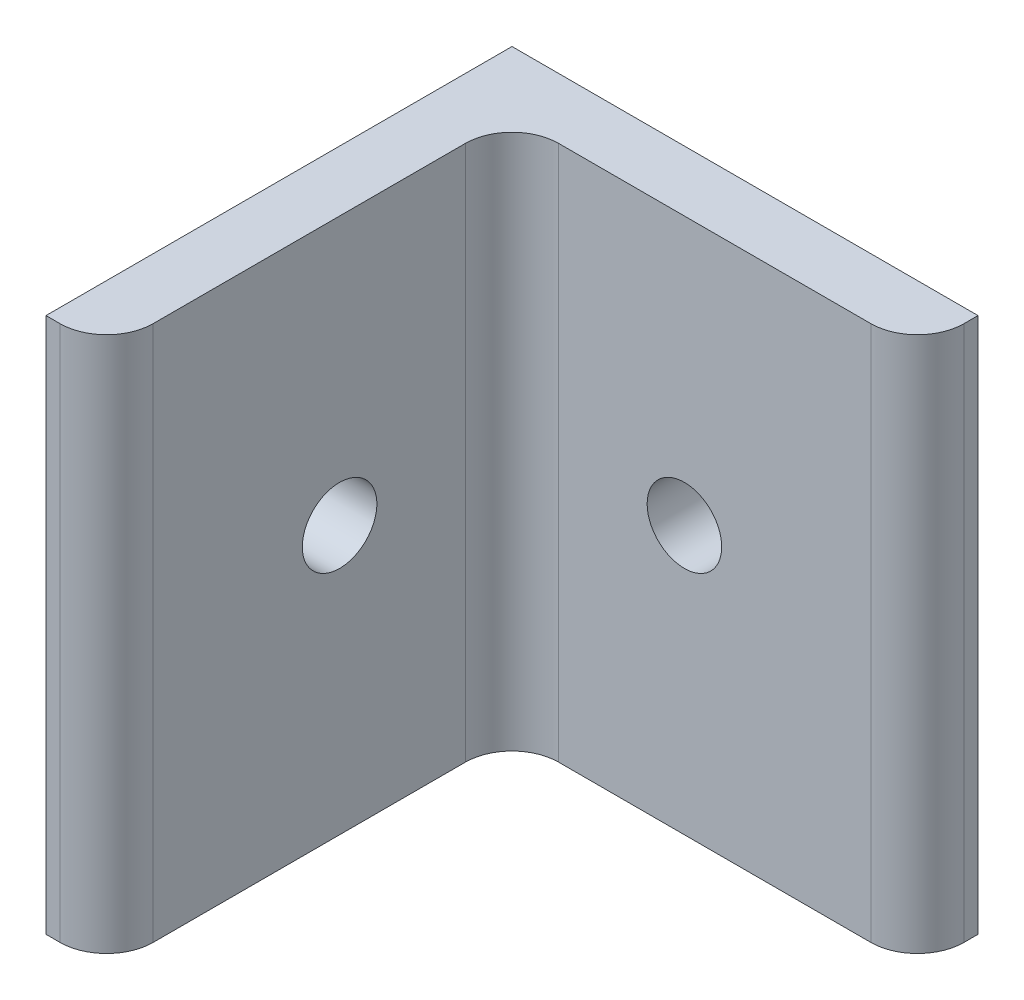
ISO-10303-21;
HEADER;
FILE_DESCRIPTION(('STEP AP214'),'2;1');
FILE_NAME('part.step','',(''),(''),'','','');
FILE_SCHEMA(('AUTOMOTIVE_DESIGN { 1 0 10303 214 1 1 1 1 }'));
ENDSEC;
DATA;
#1=APPLICATION_CONTEXT('core data for automotive mechanical design processes');
#2=APPLICATION_PROTOCOL_DEFINITION('international standard','automotive_design',2000,#1);
#3=PRODUCT_CONTEXT('',#1,'mechanical');
#4=PRODUCT('Part','Part','',(#3));
#5=PRODUCT_RELATED_PRODUCT_CATEGORY('part','',(#4));
#6=PRODUCT_DEFINITION_FORMATION('','',#4);
#7=PRODUCT_DEFINITION_CONTEXT('part definition',#1,'design');
#8=PRODUCT_DEFINITION('design','',#6,#7);
#9=PRODUCT_DEFINITION_SHAPE('','',#8);
#10=(LENGTH_UNIT() NAMED_UNIT(*) SI_UNIT(.MILLI.,.METRE.));
#11=(NAMED_UNIT(*) PLANE_ANGLE_UNIT() SI_UNIT($,.RADIAN.));
#12=(NAMED_UNIT(*) SI_UNIT($,.STERADIAN.) SOLID_ANGLE_UNIT());
#13=UNCERTAINTY_MEASURE_WITH_UNIT(LENGTH_MEASURE(1.E-05),#10,'distance_accuracy_value','');
#14=(GEOMETRIC_REPRESENTATION_CONTEXT(3) GLOBAL_UNCERTAINTY_ASSIGNED_CONTEXT((#13)) GLOBAL_UNIT_ASSIGNED_CONTEXT((#10,
#11,#12)) REPRESENTATION_CONTEXT('',''));
#15=CARTESIAN_POINT('',(0.,0.,0.));
#16=DIRECTION('',(0.,0.,1.));
#17=DIRECTION('',(1.,0.,0.));
#18=AXIS2_PLACEMENT_3D('',#15,#16,#17);
#19=CARTESIAN_POINT('',(25.4,29.21,0.));
#20=DIRECTION('',(0.,0.,1.));
#21=DIRECTION('',(1.,0.,0.));
#22=AXIS2_PLACEMENT_3D('',#19,#20,#21);
#23=PLANE('',#22);
#24=CARTESIAN_POINT('',(12.7,14.605,0.));
#25=DIRECTION('',(0.,0.,-1.));
#26=DIRECTION('',(-1.,0.,0.));
#27=AXIS2_PLACEMENT_3D('',#24,#25,#26);
#28=CIRCLE('',#27,2.03199999999999);
#29=CARTESIAN_POINT('',(10.668,14.605,0.));
#30=VERTEX_POINT('',#29);
#31=EDGE_CURVE('E198',#30,#30,#28,.T.);
#32=ORIENTED_EDGE('',*,*,#31,.F.);
#33=EDGE_LOOP('',(#32));
#34=FACE_BOUND('',#33,.T.);
#35=DIRECTION('',(-1.,0.,0.));
#36=VECTOR('',#35,1.);
#37=CARTESIAN_POINT('',(25.4,0.,0.));
#38=LINE('',#37,#36);
#39=CARTESIAN_POINT('',(25.4,0.,0.));
#40=VERTEX_POINT('',#39);
#41=CARTESIAN_POINT('',(0.,0.,0.));
#42=VERTEX_POINT('',#41);
#43=EDGE_CURVE('E142',#40,#42,#38,.T.);
#44=ORIENTED_EDGE('',*,*,#43,.T.);
#45=DIRECTION('',(0.,-1.,0.));
#46=VECTOR('',#45,1.);
#47=CARTESIAN_POINT('',(0.,29.21,0.));
#48=LINE('',#47,#46);
#49=CARTESIAN_POINT('',(0.,29.21,0.));
#50=VERTEX_POINT('',#49);
#51=EDGE_CURVE('E122',#50,#42,#48,.T.);
#52=ORIENTED_EDGE('',*,*,#51,.F.);
#53=DIRECTION('',(-1.,0.,0.));
#54=VECTOR('',#53,1.);
#55=CARTESIAN_POINT('',(25.4,29.21,0.));
#56=LINE('',#55,#54);
#57=CARTESIAN_POINT('',(25.4,29.21,0.));
#58=VERTEX_POINT('',#57);
#59=EDGE_CURVE('E130',#58,#50,#56,.T.);
#60=ORIENTED_EDGE('',*,*,#59,.F.);
#61=DIRECTION('',(0.,-1.,0.));
#62=VECTOR('',#61,1.);
#63=CARTESIAN_POINT('',(25.4,29.21,0.));
#64=LINE('',#63,#62);
#65=EDGE_CURVE('E150',#58,#40,#64,.T.);
#66=ORIENTED_EDGE('',*,*,#65,.T.);
#67=EDGE_LOOP('',(#44,#52,#60,#66));
#68=FACE_BOUND('',#67,.T.);
#69=ADVANCED_FACE('F43',(#34,#68),#23,.F.);
#70=CARTESIAN_POINT('',(0.,29.21,0.));
#71=DIRECTION('',(1.,0.,0.));
#72=DIRECTION('',(0.,0.,-1.));
#73=AXIS2_PLACEMENT_3D('',#70,#71,#72);
#74=PLANE('',#73);
#75=CARTESIAN_POINT('',(0.,14.605,12.7));
#76=DIRECTION('',(-1.,0.,0.));
#77=DIRECTION('',(0.,0.,1.));
#78=AXIS2_PLACEMENT_3D('',#75,#76,#77);
#79=CIRCLE('',#78,2.032);
#80=CARTESIAN_POINT('',(0.,14.605,14.732));
#81=VERTEX_POINT('',#80);
#82=EDGE_CURVE('E185',#81,#81,#79,.T.);
#83=ORIENTED_EDGE('',*,*,#82,.F.);
#84=EDGE_LOOP('',(#83));
#85=FACE_BOUND('',#84,.T.);
#86=DIRECTION('',(0.,0.,1.));
#87=VECTOR('',#86,1.);
#88=CARTESIAN_POINT('',(0.,0.,0.));
#89=LINE('',#88,#87);
#90=CARTESIAN_POINT('',(0.,0.,25.4));
#91=VERTEX_POINT('',#90);
#92=EDGE_CURVE('E190',#42,#91,#89,.T.);
#93=ORIENTED_EDGE('',*,*,#92,.T.);
#94=DIRECTION('',(0.,-1.,0.));
#95=VECTOR('',#94,1.);
#96=CARTESIAN_POINT('',(0.,29.21,25.4));
#97=LINE('',#96,#95);
#98=CARTESIAN_POINT('',(0.,29.21,25.4));
#99=VERTEX_POINT('',#98);
#100=EDGE_CURVE('E125',#99,#91,#97,.T.);
#101=ORIENTED_EDGE('',*,*,#100,.F.);
#102=DIRECTION('',(0.,0.,1.));
#103=VECTOR('',#102,1.);
#104=CARTESIAN_POINT('',(0.,29.21,0.));
#105=LINE('',#104,#103);
#106=EDGE_CURVE('E118',#50,#99,#105,.T.);
#107=ORIENTED_EDGE('',*,*,#106,.F.);
#108=ORIENTED_EDGE('',*,*,#51,.T.);
#109=EDGE_LOOP('',(#93,#101,#107,#108));
#110=FACE_BOUND('',#109,.T.);
#111=ADVANCED_FACE('F120',(#85,#110),#74,.F.);
#112=CARTESIAN_POINT('',(0.,29.21,25.4));
#113=DIRECTION('',(0.,0.,-1.));
#114=DIRECTION('',(-1.,0.,0.));
#115=AXIS2_PLACEMENT_3D('',#112,#113,#114);
#116=PLANE('',#115);
#117=DIRECTION('',(1.,0.,0.));
#118=VECTOR('',#117,1.);
#119=CARTESIAN_POINT('',(0.,0.,25.4));
#120=LINE('',#119,#118);
#121=CARTESIAN_POINT('',(0.762000000000005,0.,25.4));
#122=VERTEX_POINT('',#121);
#123=EDGE_CURVE('E214',#91,#122,#120,.T.);
#124=ORIENTED_EDGE('',*,*,#123,.T.);
#125=DIRECTION('',(0.,-1.,0.));
#126=VECTOR('',#125,1.);
#127=CARTESIAN_POINT('',(0.762000000000005,29.21,25.4));
#128=LINE('',#127,#126);
#129=CARTESIAN_POINT('',(0.762000000000005,29.21,25.4));
#130=VERTEX_POINT('',#129);
#131=EDGE_CURVE('E163',#122,#130,#128,.F.);
#132=ORIENTED_EDGE('',*,*,#131,.T.);
#133=DIRECTION('',(1.,0.,0.));
#134=VECTOR('',#133,1.);
#135=CARTESIAN_POINT('',(0.,29.21,25.4));
#136=LINE('',#135,#134);
#137=EDGE_CURVE('E129',#99,#130,#136,.T.);
#138=ORIENTED_EDGE('',*,*,#137,.F.);
#139=ORIENTED_EDGE('',*,*,#100,.T.);
#140=EDGE_LOOP('',(#124,#132,#138,#139));
#141=FACE_BOUND('',#140,.T.);
#142=ADVANCED_FACE('F234',(#141),#116,.F.);
#143=CARTESIAN_POINT('',(3.302,29.21,25.4));
#144=DIRECTION('',(-1.,0.,0.));
#145=DIRECTION('',(0.,0.,1.));
#146=AXIS2_PLACEMENT_3D('',#143,#144,#145);
#147=PLANE('',#146);
#148=CARTESIAN_POINT('',(3.302,14.605,12.7));
#149=DIRECTION('',(-1.,0.,0.));
#150=DIRECTION('',(0.,0.,1.));
#151=AXIS2_PLACEMENT_3D('',#148,#149,#150);
#152=CIRCLE('',#151,2.032);
#153=CARTESIAN_POINT('',(3.302,14.605,14.732));
#154=VERTEX_POINT('',#153);
#155=EDGE_CURVE('E182',#154,#154,#152,.T.);
#156=ORIENTED_EDGE('',*,*,#155,.T.);
#157=EDGE_LOOP('',(#156));
#158=FACE_BOUND('',#157,.T.);
#159=DIRECTION('',(0.,0.,-1.));
#160=VECTOR('',#159,1.);
#161=CARTESIAN_POINT('',(3.302,29.21,25.4));
#162=LINE('',#161,#160);
#163=CARTESIAN_POINT('',(3.302,29.21,22.86));
#164=VERTEX_POINT('',#163);
#165=CARTESIAN_POINT('',(3.302,29.21,5.842));
#166=VERTEX_POINT('',#165);
#167=EDGE_CURVE('E203',#164,#166,#162,.T.);
#168=ORIENTED_EDGE('',*,*,#167,.F.);
#169=DIRECTION('',(0.,-1.,0.));
#170=VECTOR('',#169,1.);
#171=CARTESIAN_POINT('',(3.302,29.21,22.86));
#172=LINE('',#171,#170);
#173=CARTESIAN_POINT('',(3.302,0.,22.86));
#174=VERTEX_POINT('',#173);
#175=EDGE_CURVE('E148',#164,#174,#172,.T.);
#176=ORIENTED_EDGE('',*,*,#175,.T.);
#177=DIRECTION('',(0.,0.,-1.));
#178=VECTOR('',#177,1.);
#179=CARTESIAN_POINT('',(3.302,0.,25.4));
#180=LINE('',#179,#178);
#181=CARTESIAN_POINT('',(3.302,0.,5.842));
#182=VERTEX_POINT('',#181);
#183=EDGE_CURVE('E218',#174,#182,#180,.T.);
#184=ORIENTED_EDGE('',*,*,#183,.T.);
#185=DIRECTION('',(0.,-1.,0.));
#186=VECTOR('',#185,1.);
#187=CARTESIAN_POINT('',(3.302,29.21,5.842));
#188=LINE('',#187,#186);
#189=EDGE_CURVE('E144',#182,#166,#188,.F.);
#190=ORIENTED_EDGE('',*,*,#189,.T.);
#191=EDGE_LOOP('',(#168,#176,#184,#190));
#192=FACE_BOUND('',#191,.T.);
#193=ADVANCED_FACE('F242',(#158,#192),#147,.F.);
#194=CARTESIAN_POINT('',(3.302,29.21,3.302));
#195=DIRECTION('',(0.,0.,-1.));
#196=DIRECTION('',(-1.,0.,0.));
#197=AXIS2_PLACEMENT_3D('',#194,#195,#196);
#198=PLANE('',#197);
#199=CARTESIAN_POINT('',(12.7,14.605,3.302));
#200=DIRECTION('',(0.,0.,-1.));
#201=DIRECTION('',(-1.,0.,0.));
#202=AXIS2_PLACEMENT_3D('',#199,#200,#201);
#203=CIRCLE('',#202,2.03199999999999);
#204=CARTESIAN_POINT('',(10.668,14.605,3.302));
#205=VERTEX_POINT('',#204);
#206=EDGE_CURVE('E47',#205,#205,#203,.T.);
#207=ORIENTED_EDGE('',*,*,#206,.T.);
#208=EDGE_LOOP('',(#207));
#209=FACE_BOUND('',#208,.T.);
#210=DIRECTION('',(1.,0.,0.));
#211=VECTOR('',#210,1.);
#212=CARTESIAN_POINT('',(3.302,0.,3.302));
#213=LINE('',#212,#211);
#214=CARTESIAN_POINT('',(5.842,0.,3.302));
#215=VERTEX_POINT('',#214);
#216=CARTESIAN_POINT('',(22.86,0.,3.302));
#217=VERTEX_POINT('',#216);
#218=EDGE_CURVE('E222',#215,#217,#213,.T.);
#219=ORIENTED_EDGE('',*,*,#218,.T.);
#220=DIRECTION('',(0.,-1.,0.));
#221=VECTOR('',#220,1.);
#222=CARTESIAN_POINT('',(22.86,29.21,3.302));
#223=LINE('',#222,#221);
#224=CARTESIAN_POINT('',(22.86,29.21,3.302));
#225=VERTEX_POINT('',#224);
#226=EDGE_CURVE('E69',#217,#225,#223,.F.);
#227=ORIENTED_EDGE('',*,*,#226,.T.);
#228=DIRECTION('',(1.,0.,0.));
#229=VECTOR('',#228,1.);
#230=CARTESIAN_POINT('',(3.302,29.21,3.302));
#231=LINE('',#230,#229);
#232=CARTESIAN_POINT('',(5.842,29.21,3.302));
#233=VERTEX_POINT('',#232);
#234=EDGE_CURVE('E207',#233,#225,#231,.T.);
#235=ORIENTED_EDGE('',*,*,#234,.F.);
#236=DIRECTION('',(0.,-1.,0.));
#237=VECTOR('',#236,1.);
#238=CARTESIAN_POINT('',(5.842,0.,3.302));
#239=LINE('',#238,#237);
#240=EDGE_CURVE('E175',#233,#215,#239,.T.);
#241=ORIENTED_EDGE('',*,*,#240,.T.);
#242=EDGE_LOOP('',(#219,#227,#235,#241));
#243=FACE_BOUND('',#242,.T.);
#244=ADVANCED_FACE('F248',(#209,#243),#198,.F.);
#245=CARTESIAN_POINT('',(25.4,29.21,3.302));
#246=DIRECTION('',(-1.,0.,0.));
#247=DIRECTION('',(0.,0.,1.));
#248=AXIS2_PLACEMENT_3D('',#245,#246,#247);
#249=PLANE('',#248);
#250=DIRECTION('',(0.,0.,-1.));
#251=VECTOR('',#250,1.);
#252=CARTESIAN_POINT('',(25.4,29.21,3.302));
#253=LINE('',#252,#251);
#254=CARTESIAN_POINT('',(25.4,29.21,0.761999999999997));
#255=VERTEX_POINT('',#254);
#256=EDGE_CURVE('E134',#255,#58,#253,.T.);
#257=ORIENTED_EDGE('',*,*,#256,.F.);
#258=DIRECTION('',(0.,-1.,0.));
#259=VECTOR('',#258,1.);
#260=CARTESIAN_POINT('',(25.4,29.21,0.761999999999996));
#261=LINE('',#260,#259);
#262=CARTESIAN_POINT('',(25.4,0.,0.761999999999997));
#263=VERTEX_POINT('',#262);
#264=EDGE_CURVE('E171',#255,#263,#261,.T.);
#265=ORIENTED_EDGE('',*,*,#264,.T.);
#266=DIRECTION('',(0.,0.,-1.));
#267=VECTOR('',#266,1.);
#268=CARTESIAN_POINT('',(25.4,0.,3.302));
#269=LINE('',#268,#267);
#270=EDGE_CURVE('E139',#263,#40,#269,.T.);
#271=ORIENTED_EDGE('',*,*,#270,.T.);
#272=ORIENTED_EDGE('',*,*,#65,.F.);
#273=EDGE_LOOP('',(#257,#265,#271,#272));
#274=FACE_BOUND('',#273,.T.);
#275=ADVANCED_FACE('F252',(#274),#249,.F.);
#276=CARTESIAN_POINT('',(0.,29.21,0.));
#277=DIRECTION('',(0.,1.,0.));
#278=DIRECTION('',(0.,0.,1.));
#279=AXIS2_PLACEMENT_3D('',#276,#277,#278);
#280=PLANE('',#279);
#281=ORIENTED_EDGE('',*,*,#137,.T.);
#282=CARTESIAN_POINT('',(0.762000000000005,29.21,22.86));
#283=DIRECTION('',(0.,1.,0.));
#284=DIRECTION('',(0.,0.,1.));
#285=AXIS2_PLACEMENT_3D('',#282,#283,#284);
#286=CIRCLE('',#285,2.54);
#287=EDGE_CURVE('E168',#130,#164,#286,.T.);
#288=ORIENTED_EDGE('',*,*,#287,.T.);
#289=ORIENTED_EDGE('',*,*,#167,.T.);
#290=CARTESIAN_POINT('',(5.842,29.21,5.842));
#291=DIRECTION('',(0.,1.,0.));
#292=DIRECTION('',(0.,0.,1.));
#293=AXIS2_PLACEMENT_3D('',#290,#291,#292);
#294=CIRCLE('',#293,2.54);
#295=EDGE_CURVE('E11',#166,#233,#294,.F.);
#296=ORIENTED_EDGE('',*,*,#295,.T.);
#297=ORIENTED_EDGE('',*,*,#234,.T.);
#298=CARTESIAN_POINT('',(22.86,29.21,0.761999999999999));
#299=DIRECTION('',(0.,1.,0.));
#300=DIRECTION('',(0.,0.,1.));
#301=AXIS2_PLACEMENT_3D('',#298,#299,#300);
#302=CIRCLE('',#301,2.54);
#303=EDGE_CURVE('E61',#225,#255,#302,.T.);
#304=ORIENTED_EDGE('',*,*,#303,.T.);
#305=ORIENTED_EDGE('',*,*,#256,.T.);
#306=ORIENTED_EDGE('',*,*,#59,.T.);
#307=ORIENTED_EDGE('',*,*,#106,.T.);
#308=EDGE_LOOP('',(#281,#288,#289,#296,#297,#304,#305,#306,#307));
#309=FACE_BOUND('',#308,.T.);
#310=ADVANCED_FACE('F133',(#309),#280,.T.);
#311=CARTESIAN_POINT('',(0.,0.,0.));
#312=DIRECTION('',(0.,1.,0.));
#313=DIRECTION('',(0.,0.,1.));
#314=AXIS2_PLACEMENT_3D('',#311,#312,#313);
#315=PLANE('',#314);
#316=ORIENTED_EDGE('',*,*,#183,.F.);
#317=CARTESIAN_POINT('',(0.762000000000005,0.,22.86));
#318=DIRECTION('',(0.,1.,0.));
#319=DIRECTION('',(0.,0.,1.));
#320=AXIS2_PLACEMENT_3D('',#317,#318,#319);
#321=CIRCLE('',#320,2.54);
#322=EDGE_CURVE('E160',#174,#122,#321,.F.);
#323=ORIENTED_EDGE('',*,*,#322,.T.);
#324=ORIENTED_EDGE('',*,*,#123,.F.);
#325=ORIENTED_EDGE('',*,*,#92,.F.);
#326=ORIENTED_EDGE('',*,*,#43,.F.);
#327=ORIENTED_EDGE('',*,*,#270,.F.);
#328=CARTESIAN_POINT('',(22.86,0.,0.761999999999999));
#329=DIRECTION('',(0.,1.,0.));
#330=DIRECTION('',(0.,0.,1.));
#331=AXIS2_PLACEMENT_3D('',#328,#329,#330);
#332=CIRCLE('',#331,2.54);
#333=EDGE_CURVE('E157',#263,#217,#332,.F.);
#334=ORIENTED_EDGE('',*,*,#333,.T.);
#335=ORIENTED_EDGE('',*,*,#218,.F.);
#336=CARTESIAN_POINT('',(5.842,0.,5.842));
#337=DIRECTION('',(0.,1.,0.));
#338=DIRECTION('',(0.,0.,1.));
#339=AXIS2_PLACEMENT_3D('',#336,#337,#338);
#340=CIRCLE('',#339,2.54);
#341=EDGE_CURVE('E53',#215,#182,#340,.T.);
#342=ORIENTED_EDGE('',*,*,#341,.T.);
#343=EDGE_LOOP('',(#316,#323,#324,#325,#326,#327,#334,#335,#342));
#344=FACE_BOUND('',#343,.T.);
#345=ADVANCED_FACE('F231',(#344),#315,.F.);
#346=CARTESIAN_POINT('',(0.762000000000005,29.21,22.86));
#347=DIRECTION('',(0.,-1.,0.));
#348=DIRECTION('',(0.,0.,-1.));
#349=AXIS2_PLACEMENT_3D('',#346,#347,#348);
#350=CYLINDRICAL_SURFACE('',#349,2.54);
#351=ORIENTED_EDGE('',*,*,#287,.F.);
#352=ORIENTED_EDGE('',*,*,#131,.F.);
#353=ORIENTED_EDGE('',*,*,#322,.F.);
#354=ORIENTED_EDGE('',*,*,#175,.F.);
#355=EDGE_LOOP('',(#351,#352,#353,#354));
#356=FACE_BOUND('',#355,.T.);
#357=ADVANCED_FACE('F240',(#356),#350,.T.);
#358=CARTESIAN_POINT('',(22.86,29.21,0.761999999999999));
#359=DIRECTION('',(0.,-1.,0.));
#360=DIRECTION('',(0.,0.,-1.));
#361=AXIS2_PLACEMENT_3D('',#358,#359,#360);
#362=CYLINDRICAL_SURFACE('',#361,2.54);
#363=ORIENTED_EDGE('',*,*,#303,.F.);
#364=ORIENTED_EDGE('',*,*,#226,.F.);
#365=ORIENTED_EDGE('',*,*,#333,.F.);
#366=ORIENTED_EDGE('',*,*,#264,.F.);
#367=EDGE_LOOP('',(#363,#364,#365,#366));
#368=FACE_BOUND('',#367,.T.);
#369=ADVANCED_FACE('F251',(#368),#362,.T.);
#370=CARTESIAN_POINT('',(5.842,29.21,5.842));
#371=DIRECTION('',(0.,1.,0.));
#372=DIRECTION('',(0.,0.,1.));
#373=AXIS2_PLACEMENT_3D('',#370,#371,#372);
#374=CYLINDRICAL_SURFACE('',#373,2.54);
#375=ORIENTED_EDGE('',*,*,#295,.F.);
#376=ORIENTED_EDGE('',*,*,#189,.F.);
#377=ORIENTED_EDGE('',*,*,#341,.F.);
#378=ORIENTED_EDGE('',*,*,#240,.F.);
#379=EDGE_LOOP('',(#375,#376,#377,#378));
#380=FACE_BOUND('',#379,.T.);
#381=ADVANCED_FACE('F45',(#380),#374,.F.);
#382=CARTESIAN_POINT('',(25.4,14.605,12.7));
#383=DIRECTION('',(-1.,0.,0.));
#384=DIRECTION('',(0.,0.,1.));
#385=AXIS2_PLACEMENT_3D('',#382,#383,#384);
#386=CYLINDRICAL_SURFACE('',#385,2.032);
#387=ORIENTED_EDGE('',*,*,#82,.T.);
#388=EDGE_LOOP('',(#387));
#389=FACE_BOUND('',#388,.T.);
#390=ORIENTED_EDGE('',*,*,#155,.F.);
#391=EDGE_LOOP('',(#390));
#392=FACE_BOUND('',#391,.T.);
#393=ADVANCED_FACE('F279',(#389,#392),#386,.F.);
#394=CARTESIAN_POINT('',(12.7,14.605,25.4));
#395=DIRECTION('',(0.,0.,-1.));
#396=DIRECTION('',(-1.,0.,0.));
#397=AXIS2_PLACEMENT_3D('',#394,#395,#396);
#398=CYLINDRICAL_SURFACE('',#397,2.03199999999999);
#399=ORIENTED_EDGE('',*,*,#31,.T.);
#400=EDGE_LOOP('',(#399));
#401=FACE_BOUND('',#400,.T.);
#402=ORIENTED_EDGE('',*,*,#206,.F.);
#403=EDGE_LOOP('',(#402));
#404=FACE_BOUND('',#403,.T.);
#405=ADVANCED_FACE('F283',(#401,#404),#398,.F.);
#406=CLOSED_SHELL('',(#69,#111,#142,#193,#244,#275,#310,#345,#357,#369,#381,#393,#405));
#407=MANIFOLD_SOLID_BREP('B2',#406);
#408=ADVANCED_BREP_SHAPE_REPRESENTATION('',(#18,#407),#14);
#409=SHAPE_DEFINITION_REPRESENTATION(#9,#408);
ENDSEC;
END-ISO-10303-21;
